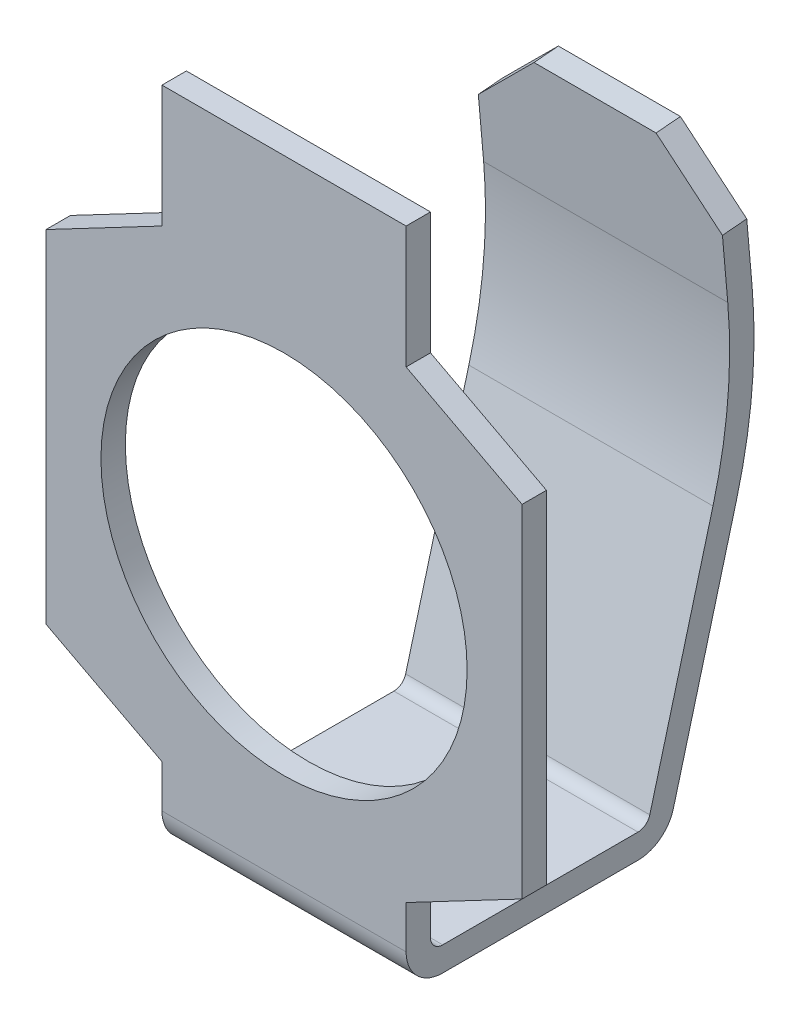
ISO-10303-21;
HEADER;
FILE_DESCRIPTION(('STEP AP214'),'2;1');
FILE_NAME('part.step','',(''),(''),'','','');
FILE_SCHEMA(('AUTOMOTIVE_DESIGN { 1 0 10303 214 1 1 1 1 }'));
ENDSEC;
DATA;
#1=APPLICATION_CONTEXT('core data for automotive mechanical design processes');
#2=APPLICATION_PROTOCOL_DEFINITION('international standard','automotive_design',2000,#1);
#3=PRODUCT_CONTEXT('',#1,'mechanical');
#4=PRODUCT('Part','Part','',(#3));
#5=PRODUCT_RELATED_PRODUCT_CATEGORY('part','',(#4));
#6=PRODUCT_DEFINITION_FORMATION('','',#4);
#7=PRODUCT_DEFINITION_CONTEXT('part definition',#1,'design');
#8=PRODUCT_DEFINITION('design','',#6,#7);
#9=PRODUCT_DEFINITION_SHAPE('','',#8);
#10=(LENGTH_UNIT() NAMED_UNIT(*) SI_UNIT(.MILLI.,.METRE.));
#11=(NAMED_UNIT(*) PLANE_ANGLE_UNIT() SI_UNIT($,.RADIAN.));
#12=(NAMED_UNIT(*) SI_UNIT($,.STERADIAN.) SOLID_ANGLE_UNIT());
#13=UNCERTAINTY_MEASURE_WITH_UNIT(LENGTH_MEASURE(1.E-05),#10,'distance_accuracy_value','');
#14=(GEOMETRIC_REPRESENTATION_CONTEXT(3) GLOBAL_UNCERTAINTY_ASSIGNED_CONTEXT((#13)) GLOBAL_UNIT_ASSIGNED_CONTEXT((#10,
#11,#12)) REPRESENTATION_CONTEXT('',''));
#15=CARTESIAN_POINT('',(0.,0.,0.));
#16=DIRECTION('',(0.,0.,1.));
#17=DIRECTION('',(1.,0.,0.));
#18=AXIS2_PLACEMENT_3D('',#15,#16,#17);
#19=CARTESIAN_POINT('',(0.,-6.70559839852027,-3.31371070983815));
#20=DIRECTION('',(0.,0.0871557427476642,-0.996194698091745));
#21=DIRECTION('',(0.,0.996194698091745,0.0871557427476642));
#22=AXIS2_PLACEMENT_3D('',#19,#20,#21);
#23=PLANE('',#22);
#24=DIRECTION('',(-1.,0.,0.));
#25=VECTOR('',#24,1.);
#26=CARTESIAN_POINT('',(1.,1.05730004801814,-2.63454509966299));
#27=LINE('',#26,#25);
#28=CARTESIAN_POINT('',(-1.,1.05730004801813,-2.63454509966299));
#29=VERTEX_POINT('',#28);
#30=CARTESIAN_POINT('',(1.,1.05730004801813,-2.63454509966299));
#31=VERTEX_POINT('',#30);
#32=EDGE_CURVE('E193',#29,#31,#27,.F.);
#33=ORIENTED_EDGE('',*,*,#32,.F.);
#34=DIRECTION('',(0.,-0.996194698091745,-0.08715574274766));
#35=VECTOR('',#34,1.);
#36=CARTESIAN_POINT('',(-1.,1.55539739706401,-2.59096722828916));
#37=LINE('',#36,#35);
#38=CARTESIAN_POINT('',(-1.,1.55539739706401,-2.59096722828916));
#39=VERTEX_POINT('',#38);
#40=EDGE_CURVE('E209',#39,#29,#37,.T.);
#41=ORIENTED_EDGE('',*,*,#40,.F.);
#42=DIRECTION('',(0.707106781186548,0.704416026402757,0.0616284167162354));
#43=VECTOR('',#42,1.);
#44=CARTESIAN_POINT('',(-1.,1.55539739706401,-2.59096722828916));
#45=LINE('',#44,#43);
#46=CARTESIAN_POINT('',(-0.5,2.05349474610988,-2.54738935691532));
#47=VERTEX_POINT('',#46);
#48=EDGE_CURVE('E212',#39,#47,#45,.T.);
#49=ORIENTED_EDGE('',*,*,#48,.T.);
#50=DIRECTION('',(1.,0.,0.));
#51=VECTOR('',#50,1.);
#52=CARTESIAN_POINT('',(-1.,2.05349474610989,-2.54738935691532));
#53=LINE('',#52,#51);
#54=CARTESIAN_POINT('',(0.5,2.05349474610988,-2.54738935691532));
#55=VERTEX_POINT('',#54);
#56=EDGE_CURVE('E225',#55,#47,#53,.F.);
#57=ORIENTED_EDGE('',*,*,#56,.F.);
#58=DIRECTION('',(0.707106781186546,-0.704416026402759,-0.0616284167162352));
#59=VECTOR('',#58,1.);
#60=CARTESIAN_POINT('',(0.5,2.05349474610988,-2.54738935691532));
#61=LINE('',#60,#59);
#62=CARTESIAN_POINT('',(1.,1.55539739706401,-2.59096722828916));
#63=VERTEX_POINT('',#62);
#64=EDGE_CURVE('E208',#55,#63,#61,.T.);
#65=ORIENTED_EDGE('',*,*,#64,.T.);
#66=DIRECTION('',(0.,0.996194698091745,0.08715574274766));
#67=VECTOR('',#66,1.);
#68=CARTESIAN_POINT('',(1.,1.05730004801814,-2.63454509966299));
#69=LINE('',#68,#67);
#70=EDGE_CURVE('E205',#31,#63,#69,.T.);
#71=ORIENTED_EDGE('',*,*,#70,.F.);
#72=EDGE_LOOP('',(#33,#41,#49,#57,#65,#71));
#73=FACE_BOUND('',#72,.T.);
#74=ADVANCED_FACE('F16',(#73),#23,.T.);
#75=CARTESIAN_POINT('',(-1.,2.03606359756035,-2.34815041729697));
#76=DIRECTION('',(0.,0.996194698091745,0.0871557427476642));
#77=DIRECTION('',(0.,-0.0871557427476642,0.996194698091745));
#78=AXIS2_PLACEMENT_3D('',#75,#76,#77);
#79=PLANE('',#78);
#80=DIRECTION('',(0.,0.0871557427476579,-0.996194698091746));
#81=VECTOR('',#80,1.);
#82=CARTESIAN_POINT('',(0.5,2.03606359756035,-2.34815041729698));
#83=LINE('',#82,#81);
#84=CARTESIAN_POINT('',(0.5,2.03606359756035,-2.34815041729698));
#85=VERTEX_POINT('',#84);
#86=EDGE_CURVE('E214',#85,#55,#83,.T.);
#87=ORIENTED_EDGE('',*,*,#86,.T.);
#88=ORIENTED_EDGE('',*,*,#56,.T.);
#89=DIRECTION('',(0.,-0.0871557427476535,0.996194698091746));
#90=VECTOR('',#89,1.);
#91=CARTESIAN_POINT('',(-0.5,2.05349474610988,-2.54738935691532));
#92=LINE('',#91,#90);
#93=CARTESIAN_POINT('',(-0.5,2.03606359756035,-2.34815041729697));
#94=VERTEX_POINT('',#93);
#95=EDGE_CURVE('E222',#47,#94,#92,.T.);
#96=ORIENTED_EDGE('',*,*,#95,.T.);
#97=DIRECTION('',(1.,0.,0.));
#98=VECTOR('',#97,1.);
#99=CARTESIAN_POINT('',(0.,2.03606359756035,-2.34815041729697));
#100=LINE('',#99,#98);
#101=EDGE_CURVE('E272',#94,#85,#100,.T.);
#102=ORIENTED_EDGE('',*,*,#101,.T.);
#103=EDGE_LOOP('',(#87,#88,#96,#102));
#104=FACE_BOUND('',#103,.T.);
#105=ADVANCED_FACE('F306',(#104),#79,.T.);
#106=CARTESIAN_POINT('',(0.5,1.91404555771362,-0.95347783996853));
#107=DIRECTION('',(-0.707106781186549,-0.704416026402757,-0.0616284167162221));
#108=DIRECTION('',(0.70575755680795,-0.70845343601995,0.));
#109=AXIS2_PLACEMENT_3D('',#106,#107,#108);
#110=PLANE('',#109);
#111=DIRECTION('',(0.70710678118655,-0.704416026402756,-0.0616284167162236));
#112=VECTOR('',#111,1.);
#113=CARTESIAN_POINT('',(0.5,2.03606359756035,-2.34815041729698));
#114=LINE('',#113,#112);
#115=CARTESIAN_POINT('',(1.,1.53796624851448,-2.3917282886708));
#116=VERTEX_POINT('',#115);
#117=EDGE_CURVE('E275',#85,#116,#114,.T.);
#118=ORIENTED_EDGE('',*,*,#117,.T.);
#119=DIRECTION('',(0.,-0.0871557427476503,0.996194698091746));
#120=VECTOR('',#119,1.);
#121=CARTESIAN_POINT('',(1.,1.55539739706401,-2.59096722828916));
#122=LINE('',#121,#120);
#123=EDGE_CURVE('E210',#63,#116,#122,.T.);
#124=ORIENTED_EDGE('',*,*,#123,.F.);
#125=ORIENTED_EDGE('',*,*,#64,.F.);
#126=ORIENTED_EDGE('',*,*,#86,.F.);
#127=EDGE_LOOP('',(#118,#124,#125,#126));
#128=FACE_BOUND('',#127,.T.);
#129=ADVANCED_FACE('F309',(#128),#110,.F.);
#130=CARTESIAN_POINT('',(-1.,1.41594820866775,-0.997055711342361));
#131=DIRECTION('',(0.707106781186547,-0.704416026402759,-0.0616284167162244));
#132=DIRECTION('',(0.705757556807952,0.708453436019948,0.));
#133=AXIS2_PLACEMENT_3D('',#130,#131,#132);
#134=PLANE('',#133);
#135=DIRECTION('',(0.707106781186548,0.704416026402758,0.0616284167162225));
#136=VECTOR('',#135,1.);
#137=CARTESIAN_POINT('',(-1.,1.53796624851448,-2.3917282886708));
#138=LINE('',#137,#136);
#139=CARTESIAN_POINT('',(-1.,1.53796624851448,-2.3917282886708));
#140=VERTEX_POINT('',#139);
#141=EDGE_CURVE('E319',#140,#94,#138,.T.);
#142=ORIENTED_EDGE('',*,*,#141,.T.);
#143=ORIENTED_EDGE('',*,*,#95,.F.);
#144=ORIENTED_EDGE('',*,*,#48,.F.);
#145=DIRECTION('',(0.,0.0871557427476577,-0.996194698091746));
#146=VECTOR('',#145,1.);
#147=CARTESIAN_POINT('',(-1.,1.53796624851448,-2.39172828867081));
#148=LINE('',#147,#146);
#149=EDGE_CURVE('E200',#140,#39,#148,.T.);
#150=ORIENTED_EDGE('',*,*,#149,.F.);
#151=EDGE_LOOP('',(#142,#143,#144,#150));
#152=FACE_BOUND('',#151,.T.);
#153=ADVANCED_FACE('F714',(#152),#134,.F.);
#154=CARTESIAN_POINT('',(1.,0.691245928477953,1.54947263232234));
#155=DIRECTION('',(-1.,0.,0.));
#156=DIRECTION('',(0.,0.,1.));
#157=AXIS2_PLACEMENT_3D('',#154,#155,#156);
#158=CYLINDRICAL_SURFACE('',#157,4.2);
#159=DIRECTION('',(1.,0.,0.));
#160=VECTOR('',#159,1.);
#161=CARTESIAN_POINT('',(0.,-0.395794060952613,-2.50741583809176));
#162=LINE('',#161,#160);
#163=CARTESIAN_POINT('',(-1.,-0.395794060952614,-2.50741583809175));
#164=VERTEX_POINT('',#163);
#165=CARTESIAN_POINT('',(1.,-0.395794060952615,-2.50741583809176));
#166=VERTEX_POINT('',#165);
#167=EDGE_CURVE('E325',#164,#166,#162,.T.);
#168=ORIENTED_EDGE('',*,*,#167,.F.);
#169=CARTESIAN_POINT('',(-1.,0.691245928477952,1.54947263232234));
#170=DIRECTION('',(-1.,0.,0.));
#171=DIRECTION('',(0.,0.,1.));
#172=AXIS2_PLACEMENT_3D('',#169,#170,#171);
#173=CIRCLE('',#172,4.2);
#174=EDGE_CURVE('E196',#29,#164,#173,.T.);
#175=ORIENTED_EDGE('',*,*,#174,.F.);
#176=ORIENTED_EDGE('',*,*,#32,.T.);
#177=CARTESIAN_POINT('',(1.,0.691245928477953,1.54947263232234));
#178=DIRECTION('',(-1.,0.,0.));
#179=DIRECTION('',(0.,0.,1.));
#180=AXIS2_PLACEMENT_3D('',#177,#178,#179);
#181=CIRCLE('',#180,4.2);
#182=EDGE_CURVE('E19',#166,#31,#181,.F.);
#183=ORIENTED_EDGE('',*,*,#182,.F.);
#184=EDGE_LOOP('',(#168,#175,#176,#183));
#185=FACE_BOUND('',#184,.T.);
#186=ADVANCED_FACE('F195',(#185),#158,.T.);
#187=CARTESIAN_POINT('',(0.,-6.7230295470698,-3.1144717702198));
#188=DIRECTION('',(0.,0.0871557427476642,-0.996194698091745));
#189=DIRECTION('',(0.,0.996194698091745,0.0871557427476642));
#190=AXIS2_PLACEMENT_3D('',#187,#188,#189);
#191=PLANE('',#190);
#192=DIRECTION('',(0.,0.996194698091745,0.0871557427476642));
#193=VECTOR('',#192,1.);
#194=CARTESIAN_POINT('',(-1.,-6.7230295470698,-3.1144717702198));
#195=LINE('',#194,#193);
#196=CARTESIAN_POINT('',(-1.,1.0398688994686,-2.43530616004464));
#197=VERTEX_POINT('',#196);
#198=EDGE_CURVE('E317',#197,#140,#195,.T.);
#199=ORIENTED_EDGE('',*,*,#198,.F.);
#200=DIRECTION('',(1.,0.,0.));
#201=VECTOR('',#200,1.);
#202=CARTESIAN_POINT('',(-1.,1.0398688994686,-2.43530616004464));
#203=LINE('',#202,#201);
#204=CARTESIAN_POINT('',(1.,1.03986889946861,-2.43530616004464));
#205=VERTEX_POINT('',#204);
#206=EDGE_CURVE('E269',#197,#205,#203,.T.);
#207=ORIENTED_EDGE('',*,*,#206,.T.);
#208=DIRECTION('',(0.,0.996194698091745,0.0871557427476642));
#209=VECTOR('',#208,1.);
#210=CARTESIAN_POINT('',(1.,-6.7230295470698,-3.1144717702198));
#211=LINE('',#210,#209);
#212=EDGE_CURVE('E281',#116,#205,#211,.F.);
#213=ORIENTED_EDGE('',*,*,#212,.F.);
#214=ORIENTED_EDGE('',*,*,#117,.F.);
#215=ORIENTED_EDGE('',*,*,#101,.F.);
#216=ORIENTED_EDGE('',*,*,#141,.F.);
#217=EDGE_LOOP('',(#199,#207,#213,#214,#215,#216));
#218=FACE_BOUND('',#217,.T.);
#219=ADVANCED_FACE('F312',(#218),#191,.F.);
#220=CARTESIAN_POINT('',(0.,-6.54716014890777,-0.859162262476007));
#221=DIRECTION('',(0.,-0.258819045102516,-0.96592582628907));
#222=DIRECTION('',(0.,0.96592582628907,-0.258819045102516));
#223=AXIS2_PLACEMENT_3D('',#220,#221,#222);
#224=PLANE('',#223);
#225=ORIENTED_EDGE('',*,*,#167,.T.);
#226=DIRECTION('',(0.,0.96592582628907,-0.258819045102516));
#227=VECTOR('',#226,1.);
#228=CARTESIAN_POINT('',(1.,-2.32764571353075,-1.98977774788672));
#229=LINE('',#228,#227);
#230=CARTESIAN_POINT('',(1.,-2.32764571353075,-1.98977774788672));
#231=VERTEX_POINT('',#230);
#232=EDGE_CURVE('E186',#231,#166,#229,.T.);
#233=ORIENTED_EDGE('',*,*,#232,.F.);
#234=DIRECTION('',(-1.,0.,0.));
#235=VECTOR('',#234,1.);
#236=CARTESIAN_POINT('',(1.,-2.32764571353075,-1.98977774788672));
#237=LINE('',#236,#235);
#238=CARTESIAN_POINT('',(-1.,-2.32764571353075,-1.98977774788672));
#239=VERTEX_POINT('',#238);
#240=EDGE_CURVE('E265',#239,#231,#237,.F.);
#241=ORIENTED_EDGE('',*,*,#240,.F.);
#242=DIRECTION('',(0.,-0.96592582628907,0.258819045102516));
#243=VECTOR('',#242,1.);
#244=CARTESIAN_POINT('',(-1.,-0.395794060952615,-2.50741583809175));
#245=LINE('',#244,#243);
#246=EDGE_CURVE('E271',#164,#239,#245,.T.);
#247=ORIENTED_EDGE('',*,*,#246,.F.);
#248=EDGE_LOOP('',(#225,#233,#241,#247));
#249=FACE_BOUND('',#248,.T.);
#250=ADVANCED_FACE('F514',(#249),#224,.T.);
#251=CARTESIAN_POINT('',(-1.,0.691245928477952,1.54947263232234));
#252=DIRECTION('',(1.,0.,0.));
#253=DIRECTION('',(0.,0.,-1.));
#254=AXIS2_PLACEMENT_3D('',#251,#252,#253);
#255=CYLINDRICAL_SURFACE('',#254,4.);
#256=CARTESIAN_POINT('',(-1.,0.691245928477952,1.54947263232234));
#257=DIRECTION('',(1.,0.,0.));
#258=DIRECTION('',(0.,0.,-1.));
#259=AXIS2_PLACEMENT_3D('',#256,#257,#258);
#260=CIRCLE('',#259,4.);
#261=CARTESIAN_POINT('',(-1.,-0.344030251932111,-2.31423067283394));
#262=VERTEX_POINT('',#261);
#263=EDGE_CURVE('E266',#262,#197,#260,.T.);
#264=ORIENTED_EDGE('',*,*,#263,.F.);
#265=DIRECTION('',(1.,0.,0.));
#266=VECTOR('',#265,1.);
#267=CARTESIAN_POINT('',(0.,-0.34403025193211,-2.31423067283394));
#268=LINE('',#267,#266);
#269=CARTESIAN_POINT('',(1.,-0.344030251932112,-2.31423067283394));
#270=VERTEX_POINT('',#269);
#271=EDGE_CURVE('E342',#262,#270,#268,.T.);
#272=ORIENTED_EDGE('',*,*,#271,.T.);
#273=CARTESIAN_POINT('',(1.,0.691245928477953,1.54947263232234));
#274=DIRECTION('',(1.,0.,0.));
#275=DIRECTION('',(0.,0.,-1.));
#276=AXIS2_PLACEMENT_3D('',#273,#274,#275);
#277=CIRCLE('',#276,4.);
#278=EDGE_CURVE('E270',#205,#270,#277,.F.);
#279=ORIENTED_EDGE('',*,*,#278,.F.);
#280=ORIENTED_EDGE('',*,*,#206,.F.);
#281=EDGE_LOOP('',(#264,#272,#279,#280));
#282=FACE_BOUND('',#281,.T.);
#283=ADVANCED_FACE('F516',(#282),#255,.F.);
#284=CARTESIAN_POINT('',(1.,-2.25,-1.7));
#285=DIRECTION('',(-1.,0.,0.));
#286=DIRECTION('',(0.,0.,1.));
#287=AXIS2_PLACEMENT_3D('',#284,#285,#286);
#288=CYLINDRICAL_SURFACE('',#287,0.3);
#289=DIRECTION('',(1.,0.,0.));
#290=VECTOR('',#289,1.);
#291=CARTESIAN_POINT('',(0.,-2.55,-1.7));
#292=LINE('',#291,#290);
#293=CARTESIAN_POINT('',(-1.,-2.55,-1.7));
#294=VERTEX_POINT('',#293);
#295=CARTESIAN_POINT('',(1.,-2.55,-1.7));
#296=VERTEX_POINT('',#295);
#297=EDGE_CURVE('E260',#294,#296,#292,.T.);
#298=ORIENTED_EDGE('',*,*,#297,.F.);
#299=CARTESIAN_POINT('',(-1.,-2.25,-1.7));
#300=DIRECTION('',(-1.,0.,0.));
#301=DIRECTION('',(0.,0.,1.));
#302=AXIS2_PLACEMENT_3D('',#299,#300,#301);
#303=CIRCLE('',#302,0.3);
#304=EDGE_CURVE('E262',#239,#294,#303,.T.);
#305=ORIENTED_EDGE('',*,*,#304,.F.);
#306=ORIENTED_EDGE('',*,*,#240,.T.);
#307=CARTESIAN_POINT('',(1.,-2.25,-1.7));
#308=DIRECTION('',(-1.,0.,0.));
#309=DIRECTION('',(0.,0.,1.));
#310=AXIS2_PLACEMENT_3D('',#307,#308,#309);
#311=CIRCLE('',#310,0.3);
#312=EDGE_CURVE('E258',#296,#231,#311,.F.);
#313=ORIENTED_EDGE('',*,*,#312,.F.);
#314=EDGE_LOOP('',(#298,#305,#306,#313));
#315=FACE_BOUND('',#314,.T.);
#316=ADVANCED_FACE('F511',(#315),#288,.T.);
#317=CARTESIAN_POINT('',(0.,-6.49539633988726,-0.665977097218192));
#318=DIRECTION('',(0.,-0.258819045102516,-0.96592582628907));
#319=DIRECTION('',(0.,0.96592582628907,-0.258819045102516));
#320=AXIS2_PLACEMENT_3D('',#317,#318,#319);
#321=PLANE('',#320);
#322=DIRECTION('',(0.,0.96592582628907,-0.258819045102516));
#323=VECTOR('',#322,1.);
#324=CARTESIAN_POINT('',(1.,-6.49539633988726,-0.665977097218193));
#325=LINE('',#324,#323);
#326=CARTESIAN_POINT('',(1.,-2.27588190451025,-1.7965925826289));
#327=VERTEX_POINT('',#326);
#328=EDGE_CURVE('E261',#270,#327,#325,.F.);
#329=ORIENTED_EDGE('',*,*,#328,.F.);
#330=ORIENTED_EDGE('',*,*,#271,.F.);
#331=DIRECTION('',(0.,0.96592582628907,-0.258819045102516));
#332=VECTOR('',#331,1.);
#333=CARTESIAN_POINT('',(-1.,-6.49539633988726,-0.665977097218192));
#334=LINE('',#333,#332);
#335=CARTESIAN_POINT('',(-1.,-2.27588190451025,-1.7965925826289));
#336=VERTEX_POINT('',#335);
#337=EDGE_CURVE('E264',#336,#262,#334,.T.);
#338=ORIENTED_EDGE('',*,*,#337,.F.);
#339=DIRECTION('',(1.,0.,0.));
#340=VECTOR('',#339,1.);
#341=CARTESIAN_POINT('',(-1.,-2.27588190451025,-1.7965925826289));
#342=LINE('',#341,#340);
#343=EDGE_CURVE('E254',#336,#327,#342,.T.);
#344=ORIENTED_EDGE('',*,*,#343,.T.);
#345=EDGE_LOOP('',(#329,#330,#338,#344));
#346=FACE_BOUND('',#345,.T.);
#347=ADVANCED_FACE('F575',(#346),#321,.F.);
#348=CARTESIAN_POINT('',(0.,-2.55,2.43274333882308));
#349=DIRECTION('',(0.,-1.,0.));
#350=DIRECTION('',(0.,0.,-1.));
#351=AXIS2_PLACEMENT_3D('',#348,#349,#350);
#352=PLANE('',#351);
#353=ORIENTED_EDGE('',*,*,#297,.T.);
#354=DIRECTION('',(0.,0.,1.));
#355=VECTOR('',#354,1.);
#356=CARTESIAN_POINT('',(1.,-2.55,-1.7));
#357=LINE('',#356,#355);
#358=CARTESIAN_POINT('',(1.,-2.55,-0.1));
#359=VERTEX_POINT('',#358);
#360=EDGE_CURVE('E351',#359,#296,#357,.F.);
#361=ORIENTED_EDGE('',*,*,#360,.F.);
#362=DIRECTION('',(-1.,0.,0.));
#363=VECTOR('',#362,1.);
#364=CARTESIAN_POINT('',(1.,-2.55,-0.1));
#365=LINE('',#364,#363);
#366=CARTESIAN_POINT('',(-1.,-2.55,-0.1));
#367=VERTEX_POINT('',#366);
#368=EDGE_CURVE('E250',#367,#359,#365,.F.);
#369=ORIENTED_EDGE('',*,*,#368,.F.);
#370=DIRECTION('',(0.,0.,1.));
#371=VECTOR('',#370,1.);
#372=CARTESIAN_POINT('',(-1.,-2.55,-0.1));
#373=LINE('',#372,#371);
#374=EDGE_CURVE('E257',#294,#367,#373,.T.);
#375=ORIENTED_EDGE('',*,*,#374,.F.);
#376=EDGE_LOOP('',(#353,#361,#369,#375));
#377=FACE_BOUND('',#376,.T.);
#378=ADVANCED_FACE('F513',(#377),#352,.T.);
#379=CARTESIAN_POINT('',(-1.,-2.25,-1.7));
#380=DIRECTION('',(1.,0.,0.));
#381=DIRECTION('',(0.,0.,-1.));
#382=AXIS2_PLACEMENT_3D('',#379,#380,#381);
#383=CYLINDRICAL_SURFACE('',#382,0.1);
#384=CARTESIAN_POINT('',(-1.,-2.25,-1.7));
#385=DIRECTION('',(1.,0.,0.));
#386=DIRECTION('',(0.,0.,-1.));
#387=AXIS2_PLACEMENT_3D('',#384,#385,#386);
#388=CIRCLE('',#387,0.1);
#389=CARTESIAN_POINT('',(-1.,-2.35,-1.7));
#390=VERTEX_POINT('',#389);
#391=EDGE_CURVE('E251',#390,#336,#388,.T.);
#392=ORIENTED_EDGE('',*,*,#391,.F.);
#393=DIRECTION('',(1.,0.,0.));
#394=VECTOR('',#393,1.);
#395=CARTESIAN_POINT('',(0.,-2.35,-1.7));
#396=LINE('',#395,#394);
#397=CARTESIAN_POINT('',(1.,-2.35,-1.7));
#398=VERTEX_POINT('',#397);
#399=EDGE_CURVE('E356',#390,#398,#396,.T.);
#400=ORIENTED_EDGE('',*,*,#399,.T.);
#401=CARTESIAN_POINT('',(1.,-2.25,-1.7));
#402=DIRECTION('',(1.,0.,0.));
#403=DIRECTION('',(0.,0.,-1.));
#404=AXIS2_PLACEMENT_3D('',#401,#402,#403);
#405=CIRCLE('',#404,0.1);
#406=EDGE_CURVE('E255',#327,#398,#405,.F.);
#407=ORIENTED_EDGE('',*,*,#406,.F.);
#408=ORIENTED_EDGE('',*,*,#343,.F.);
#409=EDGE_LOOP('',(#392,#400,#407,#408));
#410=FACE_BOUND('',#409,.T.);
#411=ADVANCED_FACE('F569',(#410),#383,.F.);
#412=CARTESIAN_POINT('',(1.,-2.25,-0.1));
#413=DIRECTION('',(-1.,0.,0.));
#414=DIRECTION('',(0.,-1.,0.));
#415=AXIS2_PLACEMENT_3D('',#412,#413,#414);
#416=CYLINDRICAL_SURFACE('',#415,0.3);
#417=DIRECTION('',(1.,0.,0.));
#418=VECTOR('',#417,1.);
#419=CARTESIAN_POINT('',(0.,-2.25,0.2));
#420=LINE('',#419,#418);
#421=CARTESIAN_POINT('',(-1.,-2.25,0.2));
#422=VERTEX_POINT('',#421);
#423=CARTESIAN_POINT('',(1.,-2.25,0.2));
#424=VERTEX_POINT('',#423);
#425=EDGE_CURVE('E245',#422,#424,#420,.T.);
#426=ORIENTED_EDGE('',*,*,#425,.F.);
#427=CARTESIAN_POINT('',(-1.,-2.25,-0.1));
#428=DIRECTION('',(-1.,0.,0.));
#429=DIRECTION('',(0.,-1.,0.));
#430=AXIS2_PLACEMENT_3D('',#427,#428,#429);
#431=CIRCLE('',#430,0.3);
#432=EDGE_CURVE('E247',#367,#422,#431,.T.);
#433=ORIENTED_EDGE('',*,*,#432,.F.);
#434=ORIENTED_EDGE('',*,*,#368,.T.);
#435=CARTESIAN_POINT('',(1.,-2.25,-0.1));
#436=DIRECTION('',(-1.,0.,0.));
#437=DIRECTION('',(0.,-1.,0.));
#438=AXIS2_PLACEMENT_3D('',#435,#436,#437);
#439=CIRCLE('',#438,0.3);
#440=EDGE_CURVE('E243',#424,#359,#439,.F.);
#441=ORIENTED_EDGE('',*,*,#440,.F.);
#442=EDGE_LOOP('',(#426,#433,#434,#441));
#443=FACE_BOUND('',#442,.T.);
#444=ADVANCED_FACE('F506',(#443),#416,.T.);
#445=CARTESIAN_POINT('',(0.,-2.35,2.43274333882308));
#446=DIRECTION('',(0.,-1.,0.));
#447=DIRECTION('',(0.,0.,-1.));
#448=AXIS2_PLACEMENT_3D('',#445,#446,#447);
#449=PLANE('',#448);
#450=DIRECTION('',(0.,0.,-1.));
#451=VECTOR('',#450,1.);
#452=CARTESIAN_POINT('',(1.,-2.35,2.43274333882308));
#453=LINE('',#452,#451);
#454=CARTESIAN_POINT('',(1.,-2.35,-0.1));
#455=VERTEX_POINT('',#454);
#456=EDGE_CURVE('E246',#398,#455,#453,.F.);
#457=ORIENTED_EDGE('',*,*,#456,.F.);
#458=ORIENTED_EDGE('',*,*,#399,.F.);
#459=DIRECTION('',(0.,0.,-1.));
#460=VECTOR('',#459,1.);
#461=CARTESIAN_POINT('',(-1.,-2.35,2.43274333882308));
#462=LINE('',#461,#460);
#463=CARTESIAN_POINT('',(-1.,-2.35,-0.1));
#464=VERTEX_POINT('',#463);
#465=EDGE_CURVE('E249',#464,#390,#462,.T.);
#466=ORIENTED_EDGE('',*,*,#465,.F.);
#467=DIRECTION('',(1.,0.,0.));
#468=VECTOR('',#467,1.);
#469=CARTESIAN_POINT('',(-1.,-2.35,-0.1));
#470=LINE('',#469,#468);
#471=EDGE_CURVE('E239',#464,#455,#470,.T.);
#472=ORIENTED_EDGE('',*,*,#471,.T.);
#473=EDGE_LOOP('',(#457,#458,#466,#472));
#474=FACE_BOUND('',#473,.T.);
#475=ADVANCED_FACE('F562',(#474),#449,.F.);
#476=CARTESIAN_POINT('',(0.,0.,0.2));
#477=DIRECTION('',(0.,0.,1.));
#478=DIRECTION('',(1.,0.,0.));
#479=AXIS2_PLACEMENT_3D('',#476,#477,#478);
#480=PLANE('',#479);
#481=CARTESIAN_POINT('',(0.,0.,0.2));
#482=DIRECTION('',(0.,0.,1.));
#483=DIRECTION('',(1.,0.,0.));
#484=AXIS2_PLACEMENT_3D('',#481,#482,#483);
#485=CIRCLE('',#484,1.5);
#486=CARTESIAN_POINT('',(1.5,0.,0.2));
#487=VERTEX_POINT('',#486);
#488=EDGE_CURVE('E232',#487,#487,#485,.F.);
#489=ORIENTED_EDGE('',*,*,#488,.T.);
#490=EDGE_LOOP('',(#489));
#491=FACE_BOUND('',#490,.T.);
#492=DIRECTION('',(-0.884918222381982,-0.465746432832623,0.));
#493=VECTOR('',#492,1.);
#494=CARTESIAN_POINT('',(-1.,1.9,0.2));
#495=LINE('',#494,#493);
#496=CARTESIAN_POINT('',(-1.95,1.4,0.2));
#497=VERTEX_POINT('',#496);
#498=CARTESIAN_POINT('',(-1.,1.9,0.2));
#499=VERTEX_POINT('',#498);
#500=EDGE_CURVE('E415',#497,#499,#495,.F.);
#501=ORIENTED_EDGE('',*,*,#500,.F.);
#502=DIRECTION('',(0.,-1.,0.));
#503=VECTOR('',#502,1.);
#504=CARTESIAN_POINT('',(-1.95,1.4,0.2));
#505=LINE('',#504,#503);
#506=CARTESIAN_POINT('',(-1.95,-1.4,0.2));
#507=VERTEX_POINT('',#506);
#508=EDGE_CURVE('E422',#507,#497,#505,.F.);
#509=ORIENTED_EDGE('',*,*,#508,.F.);
#510=DIRECTION('',(0.884918222381982,-0.465746432832623,0.));
#511=VECTOR('',#510,1.);
#512=CARTESIAN_POINT('',(-1.95,-1.4,0.2));
#513=LINE('',#512,#511);
#514=CARTESIAN_POINT('',(-1.,-1.9,0.2));
#515=VERTEX_POINT('',#514);
#516=EDGE_CURVE('E363',#515,#507,#513,.F.);
#517=ORIENTED_EDGE('',*,*,#516,.F.);
#518=DIRECTION('',(0.,1.,0.));
#519=VECTOR('',#518,1.);
#520=CARTESIAN_POINT('',(-1.,-1.9,0.2));
#521=LINE('',#520,#519);
#522=EDGE_CURVE('E361',#422,#515,#521,.T.);
#523=ORIENTED_EDGE('',*,*,#522,.F.);
#524=ORIENTED_EDGE('',*,*,#425,.T.);
#525=DIRECTION('',(0.,1.,0.));
#526=VECTOR('',#525,1.);
#527=CARTESIAN_POINT('',(1.,-2.25,0.2));
#528=LINE('',#527,#526);
#529=CARTESIAN_POINT('',(1.,-1.9,0.2));
#530=VERTEX_POINT('',#529);
#531=EDGE_CURVE('E370',#530,#424,#528,.F.);
#532=ORIENTED_EDGE('',*,*,#531,.F.);
#533=DIRECTION('',(0.884918222381983,0.465746432832622,0.));
#534=VECTOR('',#533,1.);
#535=CARTESIAN_POINT('',(1.,-1.9,0.2));
#536=LINE('',#535,#534);
#537=CARTESIAN_POINT('',(1.95,-1.4,0.2));
#538=VERTEX_POINT('',#537);
#539=EDGE_CURVE('E380',#538,#530,#536,.F.);
#540=ORIENTED_EDGE('',*,*,#539,.F.);
#541=DIRECTION('',(0.,1.,0.));
#542=VECTOR('',#541,1.);
#543=CARTESIAN_POINT('',(1.95,-1.4,0.2));
#544=LINE('',#543,#542);
#545=CARTESIAN_POINT('',(1.95,1.4,0.2));
#546=VERTEX_POINT('',#545);
#547=EDGE_CURVE('E379',#546,#538,#544,.F.);
#548=ORIENTED_EDGE('',*,*,#547,.F.);
#549=DIRECTION('',(-0.884918222381982,0.465746432832623,0.));
#550=VECTOR('',#549,1.);
#551=CARTESIAN_POINT('',(1.95,1.4,0.2));
#552=LINE('',#551,#550);
#553=CARTESIAN_POINT('',(1.,1.9,0.2));
#554=VERTEX_POINT('',#553);
#555=EDGE_CURVE('E399',#554,#546,#552,.F.);
#556=ORIENTED_EDGE('',*,*,#555,.F.);
#557=DIRECTION('',(0.,1.,0.));
#558=VECTOR('',#557,1.);
#559=CARTESIAN_POINT('',(1.,1.9,0.2));
#560=LINE('',#559,#558);
#561=CARTESIAN_POINT('',(1.,2.9,0.2));
#562=VERTEX_POINT('',#561);
#563=EDGE_CURVE('E403',#562,#554,#560,.F.);
#564=ORIENTED_EDGE('',*,*,#563,.F.);
#565=DIRECTION('',(1.,0.,0.));
#566=VECTOR('',#565,1.);
#567=CARTESIAN_POINT('',(1.,2.9,0.2));
#568=LINE('',#567,#566);
#569=CARTESIAN_POINT('',(-1.,2.9,0.2));
#570=VERTEX_POINT('',#569);
#571=EDGE_CURVE('E407',#570,#562,#568,.T.);
#572=ORIENTED_EDGE('',*,*,#571,.F.);
#573=DIRECTION('',(0.,1.,0.));
#574=VECTOR('',#573,1.);
#575=CARTESIAN_POINT('',(-1.,2.9,0.2));
#576=LINE('',#575,#574);
#577=EDGE_CURVE('E411',#499,#570,#576,.T.);
#578=ORIENTED_EDGE('',*,*,#577,.F.);
#579=EDGE_LOOP('',(#501,#509,#517,#523,#524,#532,#540,#548,#556,#564,#572,#578));
#580=FACE_BOUND('',#579,.T.);
#581=ADVANCED_FACE('F502',(#491,#580),#480,.T.);
#582=CARTESIAN_POINT('',(-1.95,-1.4,0.));
#583=DIRECTION('',(-0.465746432832623,-0.884918222381982,0.));
#584=DIRECTION('',(0.884918222381982,-0.465746432832623,0.));
#585=AXIS2_PLACEMENT_3D('',#582,#583,#584);
#586=PLANE('',#585);
#587=ORIENTED_EDGE('',*,*,#516,.T.);
#588=DIRECTION('',(0.,0.,1.));
#589=VECTOR('',#588,1.);
#590=CARTESIAN_POINT('',(-1.95,-1.4,0.));
#591=LINE('',#590,#589);
#592=CARTESIAN_POINT('',(-1.95,-1.4,0.));
#593=VERTEX_POINT('',#592);
#594=EDGE_CURVE('E419',#593,#507,#591,.T.);
#595=ORIENTED_EDGE('',*,*,#594,.F.);
#596=DIRECTION('',(0.884918222381982,-0.465746432832622,0.));
#597=VECTOR('',#596,1.);
#598=CARTESIAN_POINT('',(-1.95,-1.4,0.));
#599=LINE('',#598,#597);
#600=CARTESIAN_POINT('',(-1.,-1.9,0.));
#601=VERTEX_POINT('',#600);
#602=EDGE_CURVE('E235',#593,#601,#599,.T.);
#603=ORIENTED_EDGE('',*,*,#602,.T.);
#604=DIRECTION('',(0.,0.,1.));
#605=VECTOR('',#604,1.);
#606=CARTESIAN_POINT('',(-1.,-1.9,0.));
#607=LINE('',#606,#605);
#608=EDGE_CURVE('E242',#515,#601,#607,.F.);
#609=ORIENTED_EDGE('',*,*,#608,.F.);
#610=EDGE_LOOP('',(#587,#595,#603,#609));
#611=FACE_BOUND('',#610,.T.);
#612=ADVANCED_FACE('F498',(#611),#586,.T.);
#613=CARTESIAN_POINT('',(-1.,-1.9,0.));
#614=DIRECTION('',(-1.,0.,0.));
#615=DIRECTION('',(0.,0.,1.));
#616=AXIS2_PLACEMENT_3D('',#613,#614,#615);
#617=PLANE('',#616);
#618=ORIENTED_EDGE('',*,*,#522,.T.);
#619=ORIENTED_EDGE('',*,*,#608,.T.);
#620=DIRECTION('',(0.,1.,0.));
#621=VECTOR('',#620,1.);
#622=CARTESIAN_POINT('',(-1.,0.,0.));
#623=LINE('',#622,#621);
#624=CARTESIAN_POINT('',(-1.,-2.25,0.));
#625=VERTEX_POINT('',#624);
#626=EDGE_CURVE('E371',#601,#625,#623,.F.);
#627=ORIENTED_EDGE('',*,*,#626,.T.);
#628=CARTESIAN_POINT('',(-1.,-2.25,-0.1));
#629=DIRECTION('',(1.,0.,0.));
#630=DIRECTION('',(0.,1.,0.));
#631=AXIS2_PLACEMENT_3D('',#628,#629,#630);
#632=CIRCLE('',#631,0.1);
#633=EDGE_CURVE('E236',#625,#464,#632,.T.);
#634=ORIENTED_EDGE('',*,*,#633,.T.);
#635=ORIENTED_EDGE('',*,*,#465,.T.);
#636=ORIENTED_EDGE('',*,*,#391,.T.);
#637=ORIENTED_EDGE('',*,*,#337,.T.);
#638=ORIENTED_EDGE('',*,*,#263,.T.);
#639=ORIENTED_EDGE('',*,*,#198,.T.);
#640=ORIENTED_EDGE('',*,*,#149,.T.);
#641=ORIENTED_EDGE('',*,*,#40,.T.);
#642=ORIENTED_EDGE('',*,*,#174,.T.);
#643=ORIENTED_EDGE('',*,*,#246,.T.);
#644=ORIENTED_EDGE('',*,*,#304,.T.);
#645=ORIENTED_EDGE('',*,*,#374,.T.);
#646=ORIENTED_EDGE('',*,*,#432,.T.);
#647=EDGE_LOOP('',(#618,#619,#627,#634,#635,#636,#637,#638,#639,#640,#641,#642,#643,#644,#645,#646));
#648=FACE_BOUND('',#647,.T.);
#649=ADVANCED_FACE('F495',(#648),#617,.T.);
#650=CARTESIAN_POINT('',(-1.,-2.25,-0.1));
#651=DIRECTION('',(1.,0.,0.));
#652=DIRECTION('',(0.,1.,0.));
#653=AXIS2_PLACEMENT_3D('',#650,#651,#652);
#654=CYLINDRICAL_SURFACE('',#653,0.1);
#655=ORIENTED_EDGE('',*,*,#633,.F.);
#656=DIRECTION('',(1.,0.,0.));
#657=VECTOR('',#656,1.);
#658=CARTESIAN_POINT('',(0.,-2.25,0.));
#659=LINE('',#658,#657);
#660=CARTESIAN_POINT('',(1.,-2.25,0.));
#661=VERTEX_POINT('',#660);
#662=EDGE_CURVE('E374',#625,#661,#659,.T.);
#663=ORIENTED_EDGE('',*,*,#662,.T.);
#664=CARTESIAN_POINT('',(1.,-2.25,-0.1));
#665=DIRECTION('',(1.,0.,0.));
#666=DIRECTION('',(0.,1.,0.));
#667=AXIS2_PLACEMENT_3D('',#664,#665,#666);
#668=CIRCLE('',#667,0.1);
#669=EDGE_CURVE('E240',#455,#661,#668,.F.);
#670=ORIENTED_EDGE('',*,*,#669,.F.);
#671=ORIENTED_EDGE('',*,*,#471,.F.);
#672=EDGE_LOOP('',(#655,#663,#670,#671));
#673=FACE_BOUND('',#672,.T.);
#674=ADVANCED_FACE('F493',(#673),#654,.F.);
#675=CARTESIAN_POINT('',(1.,-2.25,0.));
#676=DIRECTION('',(1.,0.,0.));
#677=DIRECTION('',(0.,1.,0.));
#678=AXIS2_PLACEMENT_3D('',#675,#676,#677);
#679=PLANE('',#678);
#680=ORIENTED_EDGE('',*,*,#531,.T.);
#681=ORIENTED_EDGE('',*,*,#440,.T.);
#682=ORIENTED_EDGE('',*,*,#360,.T.);
#683=ORIENTED_EDGE('',*,*,#312,.T.);
#684=ORIENTED_EDGE('',*,*,#232,.T.);
#685=ORIENTED_EDGE('',*,*,#182,.T.);
#686=ORIENTED_EDGE('',*,*,#70,.T.);
#687=ORIENTED_EDGE('',*,*,#123,.T.);
#688=ORIENTED_EDGE('',*,*,#212,.T.);
#689=ORIENTED_EDGE('',*,*,#278,.T.);
#690=ORIENTED_EDGE('',*,*,#328,.T.);
#691=ORIENTED_EDGE('',*,*,#406,.T.);
#692=ORIENTED_EDGE('',*,*,#456,.T.);
#693=ORIENTED_EDGE('',*,*,#669,.T.);
#694=DIRECTION('',(0.,1.,0.));
#695=VECTOR('',#694,1.);
#696=CARTESIAN_POINT('',(1.,0.,0.));
#697=LINE('',#696,#695);
#698=CARTESIAN_POINT('',(1.,-1.9,0.));
#699=VERTEX_POINT('',#698);
#700=EDGE_CURVE('E387',#661,#699,#697,.T.);
#701=ORIENTED_EDGE('',*,*,#700,.T.);
#702=DIRECTION('',(0.,0.,1.));
#703=VECTOR('',#702,1.);
#704=CARTESIAN_POINT('',(1.,-1.9,0.));
#705=LINE('',#704,#703);
#706=EDGE_CURVE('E377',#530,#699,#705,.F.);
#707=ORIENTED_EDGE('',*,*,#706,.F.);
#708=EDGE_LOOP('',(#680,#681,#682,#683,#684,#685,#686,#687,#688,#689,#690,#691,#692,#693,#701,#707));
#709=FACE_BOUND('',#708,.T.);
#710=ADVANCED_FACE('F204',(#709),#679,.T.);
#711=CARTESIAN_POINT('',(1.,-1.9,0.));
#712=DIRECTION('',(0.465746432832622,-0.884918222381983,0.));
#713=DIRECTION('',(0.884918222381983,0.465746432832622,0.));
#714=AXIS2_PLACEMENT_3D('',#711,#712,#713);
#715=PLANE('',#714);
#716=ORIENTED_EDGE('',*,*,#539,.T.);
#717=ORIENTED_EDGE('',*,*,#706,.T.);
#718=DIRECTION('',(0.884918222381982,0.465746432832622,0.));
#719=VECTOR('',#718,1.);
#720=CARTESIAN_POINT('',(1.,-1.9,0.));
#721=LINE('',#720,#719);
#722=CARTESIAN_POINT('',(1.95,-1.4,0.));
#723=VERTEX_POINT('',#722);
#724=EDGE_CURVE('E390',#699,#723,#721,.T.);
#725=ORIENTED_EDGE('',*,*,#724,.T.);
#726=DIRECTION('',(0.,0.,1.));
#727=VECTOR('',#726,1.);
#728=CARTESIAN_POINT('',(1.95,-1.4,0.));
#729=LINE('',#728,#727);
#730=EDGE_CURVE('E397',#538,#723,#729,.F.);
#731=ORIENTED_EDGE('',*,*,#730,.F.);
#732=EDGE_LOOP('',(#716,#717,#725,#731));
#733=FACE_BOUND('',#732,.T.);
#734=ADVANCED_FACE('F487',(#733),#715,.T.);
#735=CARTESIAN_POINT('',(1.95,-1.4,0.));
#736=DIRECTION('',(1.,0.,0.));
#737=DIRECTION('',(0.,1.,0.));
#738=AXIS2_PLACEMENT_3D('',#735,#736,#737);
#739=PLANE('',#738);
#740=ORIENTED_EDGE('',*,*,#547,.T.);
#741=ORIENTED_EDGE('',*,*,#730,.T.);
#742=DIRECTION('',(0.,1.,0.));
#743=VECTOR('',#742,1.);
#744=CARTESIAN_POINT('',(1.95,0.,0.));
#745=LINE('',#744,#743);
#746=CARTESIAN_POINT('',(1.95,1.4,0.));
#747=VERTEX_POINT('',#746);
#748=EDGE_CURVE('E429',#723,#747,#745,.T.);
#749=ORIENTED_EDGE('',*,*,#748,.T.);
#750=DIRECTION('',(0.,0.,1.));
#751=VECTOR('',#750,1.);
#752=CARTESIAN_POINT('',(1.95,1.4,0.));
#753=LINE('',#752,#751);
#754=EDGE_CURVE('E401',#546,#747,#753,.F.);
#755=ORIENTED_EDGE('',*,*,#754,.F.);
#756=EDGE_LOOP('',(#740,#741,#749,#755));
#757=FACE_BOUND('',#756,.T.);
#758=ADVANCED_FACE('F481',(#757),#739,.T.);
#759=CARTESIAN_POINT('',(1.95,1.4,0.));
#760=DIRECTION('',(0.465746432832623,0.884918222381982,0.));
#761=DIRECTION('',(-0.884918222381982,0.465746432832623,0.));
#762=AXIS2_PLACEMENT_3D('',#759,#760,#761);
#763=PLANE('',#762);
#764=ORIENTED_EDGE('',*,*,#555,.T.);
#765=ORIENTED_EDGE('',*,*,#754,.T.);
#766=DIRECTION('',(-0.884918222381982,0.465746432832622,0.));
#767=VECTOR('',#766,1.);
#768=CARTESIAN_POINT('',(1.95,1.4,0.));
#769=LINE('',#768,#767);
#770=CARTESIAN_POINT('',(1.,1.9,0.));
#771=VERTEX_POINT('',#770);
#772=EDGE_CURVE('E432',#747,#771,#769,.T.);
#773=ORIENTED_EDGE('',*,*,#772,.T.);
#774=DIRECTION('',(0.,0.,1.));
#775=VECTOR('',#774,1.);
#776=CARTESIAN_POINT('',(1.,1.9,0.));
#777=LINE('',#776,#775);
#778=EDGE_CURVE('E405',#554,#771,#777,.F.);
#779=ORIENTED_EDGE('',*,*,#778,.F.);
#780=EDGE_LOOP('',(#764,#765,#773,#779));
#781=FACE_BOUND('',#780,.T.);
#782=ADVANCED_FACE('F477',(#781),#763,.T.);
#783=CARTESIAN_POINT('',(1.,1.9,0.));
#784=DIRECTION('',(1.,0.,0.));
#785=DIRECTION('',(0.,1.,0.));
#786=AXIS2_PLACEMENT_3D('',#783,#784,#785);
#787=PLANE('',#786);
#788=ORIENTED_EDGE('',*,*,#563,.T.);
#789=ORIENTED_EDGE('',*,*,#778,.T.);
#790=DIRECTION('',(0.,1.,0.));
#791=VECTOR('',#790,1.);
#792=CARTESIAN_POINT('',(1.,0.,0.));
#793=LINE('',#792,#791);
#794=CARTESIAN_POINT('',(1.,2.9,0.));
#795=VERTEX_POINT('',#794);
#796=EDGE_CURVE('E435',#771,#795,#793,.T.);
#797=ORIENTED_EDGE('',*,*,#796,.T.);
#798=DIRECTION('',(0.,0.,1.));
#799=VECTOR('',#798,1.);
#800=CARTESIAN_POINT('',(1.,2.9,0.));
#801=LINE('',#800,#799);
#802=EDGE_CURVE('E409',#562,#795,#801,.F.);
#803=ORIENTED_EDGE('',*,*,#802,.F.);
#804=EDGE_LOOP('',(#788,#789,#797,#803));
#805=FACE_BOUND('',#804,.T.);
#806=ADVANCED_FACE('F471',(#805),#787,.T.);
#807=CARTESIAN_POINT('',(1.,2.9,0.));
#808=DIRECTION('',(0.,1.,0.));
#809=DIRECTION('',(0.,0.,1.));
#810=AXIS2_PLACEMENT_3D('',#807,#808,#809);
#811=PLANE('',#810);
#812=ORIENTED_EDGE('',*,*,#571,.T.);
#813=ORIENTED_EDGE('',*,*,#802,.T.);
#814=DIRECTION('',(1.,0.,0.));
#815=VECTOR('',#814,1.);
#816=CARTESIAN_POINT('',(0.,2.9,0.));
#817=LINE('',#816,#815);
#818=CARTESIAN_POINT('',(-1.,2.9,0.));
#819=VERTEX_POINT('',#818);
#820=EDGE_CURVE('E438',#795,#819,#817,.F.);
#821=ORIENTED_EDGE('',*,*,#820,.T.);
#822=DIRECTION('',(0.,0.,1.));
#823=VECTOR('',#822,1.);
#824=CARTESIAN_POINT('',(-1.,2.9,0.));
#825=LINE('',#824,#823);
#826=EDGE_CURVE('E413',#570,#819,#825,.F.);
#827=ORIENTED_EDGE('',*,*,#826,.F.);
#828=EDGE_LOOP('',(#812,#813,#821,#827));
#829=FACE_BOUND('',#828,.T.);
#830=ADVANCED_FACE('F467',(#829),#811,.T.);
#831=CARTESIAN_POINT('',(-1.,2.9,0.));
#832=DIRECTION('',(-1.,0.,0.));
#833=DIRECTION('',(0.,0.,1.));
#834=AXIS2_PLACEMENT_3D('',#831,#832,#833);
#835=PLANE('',#834);
#836=ORIENTED_EDGE('',*,*,#577,.T.);
#837=ORIENTED_EDGE('',*,*,#826,.T.);
#838=DIRECTION('',(0.,1.,0.));
#839=VECTOR('',#838,1.);
#840=CARTESIAN_POINT('',(-1.,0.,0.));
#841=LINE('',#840,#839);
#842=CARTESIAN_POINT('',(-1.,1.9,0.));
#843=VERTEX_POINT('',#842);
#844=EDGE_CURVE('E441',#819,#843,#841,.F.);
#845=ORIENTED_EDGE('',*,*,#844,.T.);
#846=DIRECTION('',(0.,0.,1.));
#847=VECTOR('',#846,1.);
#848=CARTESIAN_POINT('',(-1.,1.9,0.));
#849=LINE('',#848,#847);
#850=EDGE_CURVE('E417',#499,#843,#849,.F.);
#851=ORIENTED_EDGE('',*,*,#850,.F.);
#852=EDGE_LOOP('',(#836,#837,#845,#851));
#853=FACE_BOUND('',#852,.T.);
#854=ADVANCED_FACE('F461',(#853),#835,.T.);
#855=CARTESIAN_POINT('',(-1.,1.9,0.));
#856=DIRECTION('',(-0.465746432832623,0.884918222381982,0.));
#857=DIRECTION('',(-0.884918222381982,-0.465746432832623,0.));
#858=AXIS2_PLACEMENT_3D('',#855,#856,#857);
#859=PLANE('',#858);
#860=ORIENTED_EDGE('',*,*,#500,.T.);
#861=ORIENTED_EDGE('',*,*,#850,.T.);
#862=DIRECTION('',(-0.884918222381982,-0.465746432832622,0.));
#863=VECTOR('',#862,1.);
#864=CARTESIAN_POINT('',(-1.,1.9,0.));
#865=LINE('',#864,#863);
#866=CARTESIAN_POINT('',(-1.95,1.4,0.));
#867=VERTEX_POINT('',#866);
#868=EDGE_CURVE('E444',#843,#867,#865,.T.);
#869=ORIENTED_EDGE('',*,*,#868,.T.);
#870=DIRECTION('',(0.,0.,1.));
#871=VECTOR('',#870,1.);
#872=CARTESIAN_POINT('',(-1.95,1.4,0.));
#873=LINE('',#872,#871);
#874=EDGE_CURVE('E34',#497,#867,#873,.F.);
#875=ORIENTED_EDGE('',*,*,#874,.F.);
#876=EDGE_LOOP('',(#860,#861,#869,#875));
#877=FACE_BOUND('',#876,.T.);
#878=ADVANCED_FACE('F456',(#877),#859,.T.);
#879=CARTESIAN_POINT('',(-1.95,1.4,0.));
#880=DIRECTION('',(-1.,0.,0.));
#881=DIRECTION('',(0.,-1.,0.));
#882=AXIS2_PLACEMENT_3D('',#879,#880,#881);
#883=PLANE('',#882);
#884=ORIENTED_EDGE('',*,*,#508,.T.);
#885=ORIENTED_EDGE('',*,*,#874,.T.);
#886=DIRECTION('',(0.,1.,0.));
#887=VECTOR('',#886,1.);
#888=CARTESIAN_POINT('',(-1.95,0.,0.));
#889=LINE('',#888,#887);
#890=EDGE_CURVE('E25',#867,#593,#889,.F.);
#891=ORIENTED_EDGE('',*,*,#890,.T.);
#892=ORIENTED_EDGE('',*,*,#594,.T.);
#893=EDGE_LOOP('',(#884,#885,#891,#892));
#894=FACE_BOUND('',#893,.T.);
#895=ADVANCED_FACE('F447',(#894),#883,.T.);
#896=CARTESIAN_POINT('',(0.,0.,0.));
#897=DIRECTION('',(0.,0.,1.));
#898=DIRECTION('',(1.,0.,0.));
#899=AXIS2_PLACEMENT_3D('',#896,#897,#898);
#900=CYLINDRICAL_SURFACE('',#899,1.5);
#901=CARTESIAN_POINT('',(0.,0.,0.));
#902=DIRECTION('',(0.,0.,1.));
#903=DIRECTION('',(1.,0.,0.));
#904=AXIS2_PLACEMENT_3D('',#901,#902,#903);
#905=CIRCLE('',#904,1.5);
#906=CARTESIAN_POINT('',(1.5,0.,0.));
#907=VERTEX_POINT('',#906);
#908=EDGE_CURVE('E11',#907,#907,#905,.F.);
#909=ORIENTED_EDGE('',*,*,#908,.T.);
#910=EDGE_LOOP('',(#909));
#911=FACE_BOUND('',#910,.T.);
#912=ORIENTED_EDGE('',*,*,#488,.F.);
#913=EDGE_LOOP('',(#912));
#914=FACE_BOUND('',#913,.T.);
#915=ADVANCED_FACE('F526',(#911,#914),#900,.F.);
#916=CARTESIAN_POINT('',(0.,0.,0.));
#917=DIRECTION('',(0.,0.,1.));
#918=DIRECTION('',(1.,0.,0.));
#919=AXIS2_PLACEMENT_3D('',#916,#917,#918);
#920=PLANE('',#919);
#921=ORIENTED_EDGE('',*,*,#908,.F.);
#922=EDGE_LOOP('',(#921));
#923=FACE_BOUND('',#922,.T.);
#924=ORIENTED_EDGE('',*,*,#868,.F.);
#925=ORIENTED_EDGE('',*,*,#844,.F.);
#926=ORIENTED_EDGE('',*,*,#820,.F.);
#927=ORIENTED_EDGE('',*,*,#796,.F.);
#928=ORIENTED_EDGE('',*,*,#772,.F.);
#929=ORIENTED_EDGE('',*,*,#748,.F.);
#930=ORIENTED_EDGE('',*,*,#724,.F.);
#931=ORIENTED_EDGE('',*,*,#700,.F.);
#932=ORIENTED_EDGE('',*,*,#662,.F.);
#933=ORIENTED_EDGE('',*,*,#626,.F.);
#934=ORIENTED_EDGE('',*,*,#602,.F.);
#935=ORIENTED_EDGE('',*,*,#890,.F.);
#936=EDGE_LOOP('',(#924,#925,#926,#927,#928,#929,#930,#931,#932,#933,#934,#935));
#937=FACE_BOUND('',#936,.T.);
#938=ADVANCED_FACE('F452',(#923,#937),#920,.F.);
#939=CLOSED_SHELL('',(#74,#105,#129,#153,#186,#219,#250,#283,#316,#347,#378,#411,#444,#475,#581,
#612,#649,#674,#710,#734,#758,#782,#806,#830,#854,#878,#895,#915,#938));
#940=MANIFOLD_SOLID_BREP('B1',#939);
#941=ADVANCED_BREP_SHAPE_REPRESENTATION('',(#18,#940),#14);
#942=SHAPE_DEFINITION_REPRESENTATION(#9,#941);
ENDSEC;
END-ISO-10303-21;
